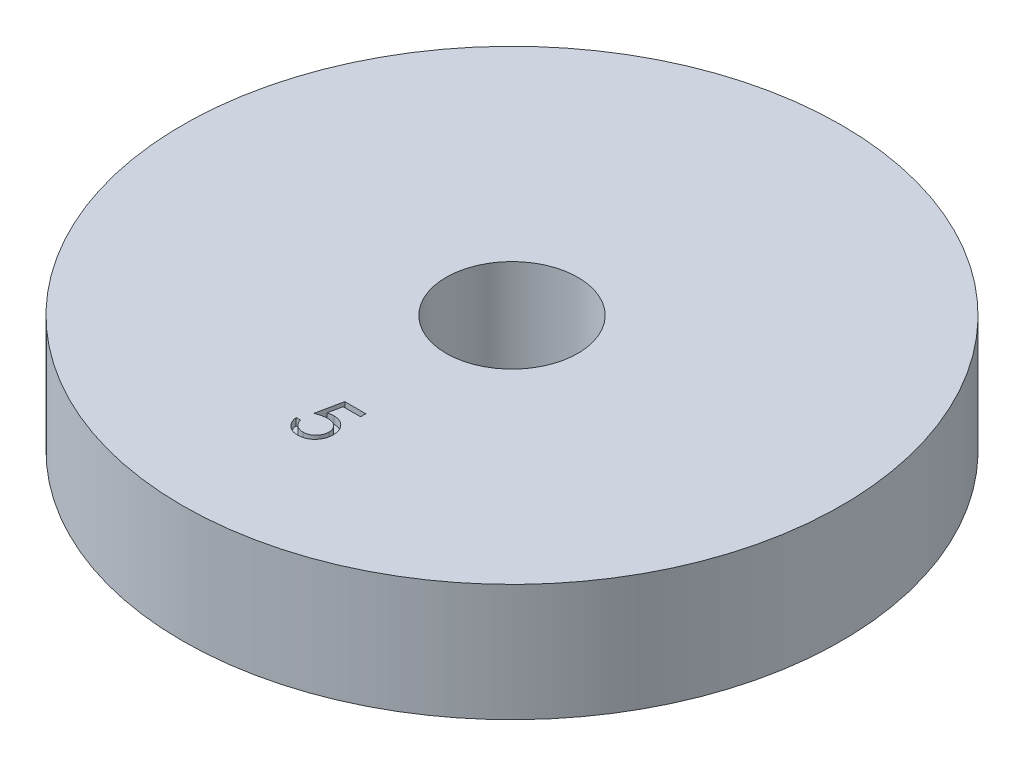
ISO-10303-21;
HEADER;
FILE_DESCRIPTION(('STEP AP214'),'2;1');
FILE_NAME('part.step','',(''),(''),'','','');
FILE_SCHEMA(('AUTOMOTIVE_DESIGN { 1 0 10303 214 1 1 1 1 }'));
ENDSEC;
DATA;
#1=APPLICATION_CONTEXT('core data for automotive mechanical design processes');
#2=APPLICATION_PROTOCOL_DEFINITION('international standard','automotive_design',2000,#1);
#3=PRODUCT_CONTEXT('',#1,'mechanical');
#4=PRODUCT('Part','Part','',(#3));
#5=PRODUCT_RELATED_PRODUCT_CATEGORY('part','',(#4));
#6=PRODUCT_DEFINITION_FORMATION('','',#4);
#7=PRODUCT_DEFINITION_CONTEXT('part definition',#1,'design');
#8=PRODUCT_DEFINITION('design','',#6,#7);
#9=PRODUCT_DEFINITION_SHAPE('','',#8);
#10=(LENGTH_UNIT() NAMED_UNIT(*) SI_UNIT(.MILLI.,.METRE.));
#11=(NAMED_UNIT(*) PLANE_ANGLE_UNIT() SI_UNIT($,.RADIAN.));
#12=(NAMED_UNIT(*) SI_UNIT($,.STERADIAN.) SOLID_ANGLE_UNIT());
#13=UNCERTAINTY_MEASURE_WITH_UNIT(LENGTH_MEASURE(1.E-05),#10,'distance_accuracy_value','');
#14=(GEOMETRIC_REPRESENTATION_CONTEXT(3) GLOBAL_UNCERTAINTY_ASSIGNED_CONTEXT((#13)) GLOBAL_UNIT_ASSIGNED_CONTEXT((#10,
#11,#12)) REPRESENTATION_CONTEXT('',''));
#15=CARTESIAN_POINT('',(0.,0.,0.));
#16=DIRECTION('',(0.,0.,1.));
#17=DIRECTION('',(1.,0.,0.));
#18=AXIS2_PLACEMENT_3D('',#15,#16,#17);
#19=CARTESIAN_POINT('',(0.,8.,0.));
#20=DIRECTION('',(0.,1.,0.));
#21=DIRECTION('',(0.,0.,1.));
#22=AXIS2_PLACEMENT_3D('',#19,#20,#21);
#23=PLANE('',#22);
#24=CARTESIAN_POINT('',(0.,8.,0.));
#25=DIRECTION('',(0.,1.,0.));
#26=DIRECTION('',(0.,0.,1.));
#27=AXIS2_PLACEMENT_3D('',#24,#25,#26);
#28=CIRCLE('',#27,4.5);
#29=CARTESIAN_POINT('',(0.,8.,4.5));
#30=VERTEX_POINT('',#29);
#31=EDGE_CURVE('E298',#30,#30,#28,.T.);
#32=ORIENTED_EDGE('',*,*,#31,.F.);
#33=EDGE_LOOP('',(#32));
#34=FACE_BOUND('',#33,.T.);
#35=CARTESIAN_POINT('',(0.,8.,0.));
#36=DIRECTION('',(0.,1.,0.));
#37=DIRECTION('',(0.,0.,1.));
#38=AXIS2_PLACEMENT_3D('',#35,#36,#37);
#39=CIRCLE('',#38,22.5);
#40=CARTESIAN_POINT('',(0.,8.,22.5));
#41=VERTEX_POINT('',#40);
#42=EDGE_CURVE('E11',#41,#41,#39,.T.);
#43=ORIENTED_EDGE('',*,*,#42,.T.);
#44=EDGE_LOOP('',(#43));
#45=FACE_BOUND('',#44,.T.);
#46=DIRECTION('',(0.200944143721331,0.,-0.97960270064149));
#47=VECTOR('',#46,1.);
#48=CARTESIAN_POINT('',(-0.967671836708835,8.,12.5582670641185));
#49=LINE('',#48,#47);
#50=CARTESIAN_POINT('',(-0.967671836708835,8.,12.5582670641185));
#51=VERTEX_POINT('',#50);
#52=CARTESIAN_POINT('',(-0.608697477734477,8.,10.8082670641185));
#53=VERTEX_POINT('',#52);
#54=EDGE_CURVE('E264',#51,#53,#49,.T.);
#55=ORIENTED_EDGE('',*,*,#54,.T.);
#56=DIRECTION('',(1.,0.,0.));
#57=VECTOR('',#56,1.);
#58=CARTESIAN_POINT('',(-0.608697477734476,8.,10.8082670641185));
#59=LINE('',#58,#57);
#60=CARTESIAN_POINT('',(0.82719995816296,8.,10.8082670641185));
#61=VERTEX_POINT('',#60);
#62=EDGE_CURVE('E54',#53,#61,#59,.T.);
#63=ORIENTED_EDGE('',*,*,#62,.T.);
#64=DIRECTION('',(0.,0.,1.));
#65=VECTOR('',#64,1.);
#66=CARTESIAN_POINT('',(0.82719995816296,8.,10.8082670641185));
#67=LINE('',#66,#65);
#68=CARTESIAN_POINT('',(0.82719995816296,8.,11.1672414230929));
#69=VERTEX_POINT('',#68);
#70=EDGE_CURVE('E357',#61,#69,#67,.T.);
#71=ORIENTED_EDGE('',*,*,#70,.T.);
#72=DIRECTION('',(-1.,0.,0.));
#73=VECTOR('',#72,1.);
#74=CARTESIAN_POINT('',(0.82719995816296,8.,11.1672414230929));
#75=LINE('',#74,#73);
#76=CARTESIAN_POINT('',(-0.363304849529348,8.,11.1672414230929));
#77=VERTEX_POINT('',#76);
#78=EDGE_CURVE('E353',#69,#77,#75,.T.);
#79=ORIENTED_EDGE('',*,*,#78,.T.);
#80=DIRECTION('',(-0.200705474463135,0.,0.979651628141621));
#81=VECTOR('',#80,1.);
#82=CARTESIAN_POINT('',(-0.363304849529348,8.,11.1672414230929));
#83=LINE('',#82,#81);
#84=CARTESIAN_POINT('',(-0.551906612349861,8.,12.0878143397596));
#85=VERTEX_POINT('',#84);
#86=EDGE_CURVE('E346',#77,#85,#83,.T.);
#87=ORIENTED_EDGE('',*,*,#86,.T.);
#88=CARTESIAN_POINT('',(-0.551906612349861,8.,12.0878143397596));
#89=CARTESIAN_POINT('',(-0.514850737976193,8.,12.0775840679493));
#90=CARTESIAN_POINT('',(-0.443060842143816,8.,12.0577645343393));
#91=CARTESIAN_POINT('',(-0.337100981180093,8.,12.0357587639098));
#92=CARTESIAN_POINT('',(-0.236508777709103,8.,12.0224933198524));
#93=CARTESIAN_POINT('',(-0.171233407298597,8.,12.0206820093402));
#94=CARTESIAN_POINT('',(-0.139646996965245,8.,12.019805525657));
#95=B_SPLINE_CURVE_WITH_KNOTS('',3,(#88,#89,#90,#91,#92,#93,#94),.UNSPECIFIED.,.F.,.F.,(4,1,1,1,
4),(0.,0.275068369018743,0.532901460089936,0.773973459592445,1.),.UNSPECIFIED.);
#96=CARTESIAN_POINT('',(-0.139646996965245,8.,12.019805525657));
#97=VERTEX_POINT('',#96);
#98=EDGE_CURVE('E352',#85,#97,#95,.T.);
#99=ORIENTED_EDGE('',*,*,#98,.T.);
#100=CARTESIAN_POINT('',(-0.139646996965245,8.,12.019805525657));
#101=CARTESIAN_POINT('',(-0.100563257253044,8.,12.0206514613516));
#102=CARTESIAN_POINT('',(-0.023714859927914,8.,12.0223147822839));
#103=CARTESIAN_POINT('',(0.0887240870657147,8.,12.0382866317282));
#104=CARTESIAN_POINT('',(0.196056980283833,8.,12.0634265463584));
#105=CARTESIAN_POINT('',(0.298059350460181,8.,12.0985470680951));
#106=CARTESIAN_POINT('',(0.39491990109746,8.,12.1434568012894));
#107=CARTESIAN_POINT('',(0.485747462577982,8.,12.1995567416473));
#108=CARTESIAN_POINT('',(0.571905375564809,8.,12.2650900727969));
#109=CARTESIAN_POINT('',(0.651847969518984,8.,12.3404350847565));
#110=CARTESIAN_POINT('',(0.724372277684403,8.,12.4233567015087));
#111=CARTESIAN_POINT('',(0.788138267351387,8.,12.5125145725522));
#112=CARTESIAN_POINT('',(0.84230085765566,8.,12.6070422346867));
#113=CARTESIAN_POINT('',(0.885861612532083,8.,12.707842843425));
#114=CARTESIAN_POINT('',(0.92064594680803,8.,12.8138019968353));
#115=CARTESIAN_POINT('',(0.943797941651836,8.,12.9260345793876));
#116=CARTESIAN_POINT('',(0.959214650613127,8.,13.043482699401));
#117=CARTESIAN_POINT('',(0.96093703693271,8.,13.1237872694781));
#118=CARTESIAN_POINT('',(0.961815342778344,8.,13.1647374166826));
#119=B_SPLINE_CURVE_WITH_KNOTS('',3,(#100,#101,#102,#103,#104,#105,#106,#107,#108,#109,#110,
#111,#112,#113,#114,#115,#116,#117,#118),.UNSPECIFIED.,.F.,.F.,(4,1,1,1,1,1,1,1,1,1,1,1,1,1,1,1,
4),(0.,0.0658076458106948,0.129394273668056,0.19089406063219,0.251281068929836,
0.310814964465273,0.370370987448245,0.430768262589727,0.492881250617502,0.55510394815525,
0.616067050993843,0.677256033174654,0.738259805199117,0.800762134376296,0.864777581574484,
0.931045294999404,1.),.UNSPECIFIED.);
#120=CARTESIAN_POINT('',(0.961815342778344,8.,13.1647374166826));
#121=VERTEX_POINT('',#120);
#122=EDGE_CURVE('E365',#97,#121,#119,.T.);
#123=ORIENTED_EDGE('',*,*,#122,.T.);
#124=CARTESIAN_POINT('',(0.961815342778344,8.,13.1647374166826));
#125=CARTESIAN_POINT('',(0.961150267504974,8.,13.1932596370346));
#126=CARTESIAN_POINT('',(0.95982910487507,8.,13.2499186246104));
#127=CARTESIAN_POINT('',(0.953110517227282,8.,13.3340628252957));
#128=CARTESIAN_POINT('',(0.940174801163103,8.,13.4164256583781));
#129=CARTESIAN_POINT('',(0.922807077059055,8.,13.4970180502168));
#130=CARTESIAN_POINT('',(0.900264659093549,8.,13.5756874223959));
#131=CARTESIAN_POINT('',(0.872975605191223,8.,13.6526589503227));
#132=CARTESIAN_POINT('',(0.839579577681365,8.,13.7274535570658));
#133=CARTESIAN_POINT('',(0.802948202422442,8.,13.8007789520896));
#134=CARTESIAN_POINT('',(0.761701724387125,8.,13.8709774592843));
#135=CARTESIAN_POINT('',(0.715923217048165,8.,13.936626445827));
#136=CARTESIAN_POINT('',(0.667557725825836,8.,13.998710727307));
#137=CARTESIAN_POINT('',(0.615516340367556,8.,14.0565644603161));
#138=CARTESIAN_POINT('',(0.559315345254962,8.,14.1098074782091));
#139=CARTESIAN_POINT('',(0.499635378393252,8.,14.1587557597151));
#140=CARTESIAN_POINT('',(0.436952659364128,8.,14.2042370900182));
#141=CARTESIAN_POINT('',(0.37029741704317,8.,14.2444052851937));
#142=CARTESIAN_POINT('',(0.301154934079605,8.,14.2813682413465));
#143=CARTESIAN_POINT('',(0.228526716939122,8.,14.3116917786818));
#144=CARTESIAN_POINT('',(0.154066016481617,8.,14.3388023067668));
#145=CARTESIAN_POINT('',(0.0767011408867827,8.,14.3604118343784));
#146=CARTESIAN_POINT('',(-0.00339267172897991,8.,14.3773443888977));
#147=CARTESIAN_POINT('',(-0.0863474472110704,8.,14.3888449895002));
#148=CARTESIAN_POINT('',(-0.171728117234819,8.,14.3972214269704));
#149=CARTESIAN_POINT('',(-0.229603129814692,8.,14.397745783921));
#150=CARTESIAN_POINT('',(-0.25883770209345,8.,14.3980106538621));
#151=B_SPLINE_CURVE_WITH_KNOTS('',3,(#124,#125,#126,#127,#128,#129,#130,#131,#132,#133,#134,
#135,#136,#137,#138,#139,#140,#141,#142,#143,#144,#145,#146,#147,#148,#149,#150),.UNSPECIFIED.,
.F.,.F.,(4,1,1,1,1,1,1,1,1,1,1,1,1,1,1,1,1,1,1,1,1,1,1,1,4),(0.,0.0440144705761401,
0.0874341236677053,0.130118398657898,0.172553694558183,0.214554755968139,0.256298092097131,
0.29843822513325,0.340849002588096,0.382715188967027,0.423924045407532,0.464246243250417,
0.504073671461796,0.543861905868492,0.583566724979654,0.623094318852334,0.663229060768585,
0.70355125861147,0.743937894686185,0.784541254800093,0.825750111240597,0.867757363388507,
0.91074516403231,0.954914446891478,1.),.UNSPECIFIED.);
#152=CARTESIAN_POINT('',(-0.25883770209345,8.,14.3980106538621));
#153=VERTEX_POINT('',#152);
#154=EDGE_CURVE('E373',#121,#153,#151,.T.);
#155=ORIENTED_EDGE('',*,*,#154,.T.);
#156=CARTESIAN_POINT('',(-0.25883770209345,8.,14.3980106538621));
#157=CARTESIAN_POINT('',(-0.29371188279566,8.,14.397319815878));
#158=CARTESIAN_POINT('',(-0.362322713499546,8.,14.3959606737556));
#159=CARTESIAN_POINT('',(-0.462843280571111,8.,14.3817421885015));
#160=CARTESIAN_POINT('',(-0.559557886264573,8.,14.361378272109));
#161=CARTESIAN_POINT('',(-0.651687987421995,8.,14.3307420022606));
#162=CARTESIAN_POINT('',(-0.740059251127233,8.,14.2923547075704));
#163=CARTESIAN_POINT('',(-0.823481968916085,8.00000000000001,14.243838536075));
#164=CARTESIAN_POINT('',(-0.904087744963954,8.,14.1888594323279));
#165=CARTESIAN_POINT('',(-0.978599781713458,8.,14.1239790793632));
#166=CARTESIAN_POINT('',(-1.04775589518311,8.,14.0530633973306));
#167=CARTESIAN_POINT('',(-1.10966240405344,8.,13.9761057561649));
#168=CARTESIAN_POINT('',(-1.1647959807901,8.,13.8943763140788));
#169=CARTESIAN_POINT('',(-1.21227372777894,8.,13.8074781600031));
#170=CARTESIAN_POINT('',(-1.25277174909533,8.,13.7156396290654));
#171=CARTESIAN_POINT('',(-1.28458673737204,8.,13.6185166281735));
#172=CARTESIAN_POINT('',(-1.31026509231516,8.,13.5166166242341));
#173=CARTESIAN_POINT('',(-1.32112851279152,8.,13.4464631138236));
#174=CARTESIAN_POINT('',(-1.32664619568319,8.,13.4108311666826));
#175=B_SPLINE_CURVE_WITH_KNOTS('',3,(#156,#157,#158,#159,#160,#161,#162,#163,#164,#165,#166,
#167,#168,#169,#170,#171,#172,#173,#174),.UNSPECIFIED.,.F.,.F.,(4,1,1,1,1,1,1,1,1,1,1,1,1,1,1,1,
4),(0.,0.0654211437588925,0.128708371881883,0.190236141863538,0.250724402033538,
0.310637179413444,0.370766408289726,0.431614744412353,0.493522973566354,0.555883455377533,
0.61734236731851,0.678668039097275,0.740711359545147,0.802985362512744,0.866802580265517,
0.932347171345887,1.),.UNSPECIFIED.);
#176=CARTESIAN_POINT('',(-1.32664619568319,8.,13.4108311666826));
#177=VERTEX_POINT('',#176);
#178=EDGE_CURVE('E381',#153,#177,#175,.T.);
#179=ORIENTED_EDGE('',*,*,#178,.T.);
#180=DIRECTION('',(1.,0.,0.));
#181=VECTOR('',#180,1.);
#182=CARTESIAN_POINT('',(-1.32664619568319,8.,13.4108311666826));
#183=LINE('',#182,#181);
#184=CARTESIAN_POINT('',(-1.01254363158063,8.,13.4108311666826));
#185=VERTEX_POINT('',#184);
#186=EDGE_CURVE('E389',#177,#185,#183,.T.);
#187=ORIENTED_EDGE('',*,*,#186,.T.);
#188=CARTESIAN_POINT('',(-1.01254363158063,8.,13.4108311666826));
#189=CARTESIAN_POINT('',(-1.00481507419047,8.,13.4442076191313));
#190=CARTESIAN_POINT('',(-0.989960357749593,8.,13.5083590140032));
#191=CARTESIAN_POINT('',(-0.957354608997612,8.,13.5984903553363));
#192=CARTESIAN_POINT('',(-0.917488733524893,8.,13.6788095790123));
#193=CARTESIAN_POINT('',(-0.870084385107619,8.,13.7503791622859));
#194=CARTESIAN_POINT('',(-0.813534354621399,8.,13.8127881595582));
#195=CARTESIAN_POINT('',(-0.749004925680748,8.,13.8684052214959));
#196=CARTESIAN_POINT('',(-0.676657202481521,8.,13.9185803508235));
#197=CARTESIAN_POINT('',(-0.596263972961626,8.,13.9604031180208));
#198=CARTESIAN_POINT('',(-0.511450893641255,8.,13.9960718714208));
#199=CARTESIAN_POINT('',(-0.422683683631667,8.,14.0198235663725));
#200=CARTESIAN_POINT('',(-0.332379337160577,8.,14.0365244592153));
#201=CARTESIAN_POINT('',(-0.271300966964081,8.,14.038196220017));
#202=CARTESIAN_POINT('',(-0.240608535426784,8.,14.0390362948878));
#203=B_SPLINE_CURVE_WITH_KNOTS('',3,(#188,#189,#190,#191,#192,#193,#194,#195,#196,#197,#198,
#199,#200,#201,#202),.UNSPECIFIED.,.F.,.F.,(4,1,1,1,1,1,1,1,1,1,1,1,4),(0.,0.094687251867555,
0.181994155707275,0.264376948610513,0.342179861947772,0.418617610862147,0.496509075371909,
0.577369091611732,0.661510592454199,0.746732550829198,0.831257984327743,0.915205616213655,1.),.UNSPECIFIED.);
#204=CARTESIAN_POINT('',(-0.240608535426784,8.,14.0390362948878));
#205=VERTEX_POINT('',#204);
#206=EDGE_CURVE('E395',#185,#205,#203,.T.);
#207=ORIENTED_EDGE('',*,*,#206,.T.);
#208=CARTESIAN_POINT('',(-0.240608535426784,8.,14.0390362948878));
#209=CARTESIAN_POINT('',(-0.210650091009496,8.,14.0382155169827));
#210=CARTESIAN_POINT('',(-0.151661668820922,8.,14.0365993985716));
#211=CARTESIAN_POINT('',(-0.064850282127918,8.,14.0241603864817));
#212=CARTESIAN_POINT('',(0.0189625920742209,8.,14.0050028151741));
#213=CARTESIAN_POINT('',(0.0989499488331858,8.,13.9763329601904));
#214=CARTESIAN_POINT('',(0.17651148842223,8.,13.9414882417645));
#215=CARTESIAN_POINT('',(0.249685258845327,8.,13.8967731659487));
#216=CARTESIAN_POINT('',(0.320588135985995,8.,13.8453131475037));
#217=CARTESIAN_POINT('',(0.387016269507047,8.,13.7863565174603));
#218=CARTESIAN_POINT('',(0.447855718766602,8.,13.721386822841));
#219=CARTESIAN_POINT('',(0.50161183990052,8.,13.6519094294161));
#220=CARTESIAN_POINT('',(0.546388753326672,8.,13.5777925828732));
#221=CARTESIAN_POINT('',(0.58412286219636,8.,13.5003194300223));
#222=CARTESIAN_POINT('',(0.612776161018993,8.,13.4186408728439));
#223=CARTESIAN_POINT('',(0.633217142241795,8.,13.3331396976715));
#224=CARTESIAN_POINT('',(0.645220201060291,8.,13.243604717465));
#225=CARTESIAN_POINT('',(0.646871381032259,8.,13.1825354076888));
#226=CARTESIAN_POINT('',(0.64771277867578,8.,13.1514161025801));
#227=B_SPLINE_CURVE_WITH_KNOTS('',3,(#208,#209,#210,#211,#212,#213,#214,#215,#216,#217,#218,
#219,#220,#221,#222,#223,#224,#225,#226),.UNSPECIFIED.,.F.,.F.,(4,1,1,1,1,1,1,1,1,1,1,1,1,1,1,1,
4),(0.,0.0642072952829856,0.126424689779743,0.187680284264922,0.248216424455213,
0.308305060008613,0.369660991325143,0.431698551786781,0.495946892208765,0.55975802397212,
0.622295407826159,0.683910635284175,0.745092408056625,0.806740225389293,0.869086618121203,
0.9332900029748,1.),.UNSPECIFIED.);
#228=CARTESIAN_POINT('',(0.64771277867578,8.,13.1514161025801));
#229=VERTEX_POINT('',#228);
#230=EDGE_CURVE('E400',#205,#229,#227,.T.);
#231=ORIENTED_EDGE('',*,*,#230,.T.);
#232=CARTESIAN_POINT('',(0.64771277867578,8.,13.1514161025801));
#233=CARTESIAN_POINT('',(0.647054299214329,8.,13.1233403509589));
#234=CARTESIAN_POINT('',(0.645765419359936,8.,13.0683860619037));
#235=CARTESIAN_POINT('',(0.635234849056979,8.,12.9879868554624));
#236=CARTESIAN_POINT('',(0.616917876703277,8.,12.9119138131608));
#237=CARTESIAN_POINT('',(0.591493996756317,8.,12.8397995791889));
#238=CARTESIAN_POINT('',(0.559214489022716,8.,12.7715761368408));
#239=CARTESIAN_POINT('',(0.519768176703893,8.,12.7071730766406));
#240=CARTESIAN_POINT('',(0.472414778760391,8.,12.6474392434172));
#241=CARTESIAN_POINT('',(0.418322890171726,8.,12.5923466898077));
#242=CARTESIAN_POINT('',(0.359064849228643,8.,12.5415018149345));
#243=CARTESIAN_POINT('',(0.293621106631516,8.,12.4981577284826));
#244=CARTESIAN_POINT('',(0.223361179836368,8.,12.4616938108308));
#245=CARTESIAN_POINT('',(0.149131580367511,8.,12.430225812488));
#246=CARTESIAN_POINT('',(0.0691666817801094,8.,12.4076250670887));
#247=CARTESIAN_POINT('',(-0.0149499505992889,8.,12.3906571816466));
#248=CARTESIAN_POINT('',(-0.104126658546245,8.,12.3808418189683));
#249=CARTESIAN_POINT('',(-0.165097346680199,8.,12.3794799305926));
#250=CARTESIAN_POINT('',(-0.196437862349861,8.,12.3787798846313));
#251=B_SPLINE_CURVE_WITH_KNOTS('',3,(#232,#233,#234,#235,#236,#237,#238,#239,#240,#241,#242,
#243,#244,#245,#246,#247,#248,#249,#250),.UNSPECIFIED.,.F.,.F.,(4,1,1,1,1,1,1,1,1,1,1,1,1,1,1,1,
4),(0.,0.0653513820265941,0.127916031830613,0.1883602055717,0.247216077265452,0.305630129197412,
0.363769839831819,0.422660913912781,0.482687294090392,0.543300221239559,0.604117955323103,
0.664964891265285,0.727413494112565,0.791467625149424,0.8580554427291,0.927036814614948,1.),.UNSPECIFIED.);
#252=CARTESIAN_POINT('',(-0.196437862349861,8.,12.3787798846313));
#253=VERTEX_POINT('',#252);
#254=EDGE_CURVE('E269',#229,#253,#251,.T.);
#255=ORIENTED_EDGE('',*,*,#254,.T.);
#256=CARTESIAN_POINT('',(-0.196437862349861,8.,12.3787798846313));
#257=CARTESIAN_POINT('',(-0.223566791156285,8.,12.3793604757889));
#258=CARTESIAN_POINT('',(-0.279581146480988,8.,12.3805592492323));
#259=CARTESIAN_POINT('',(-0.365503973210251,8.,12.3893857460586));
#260=CARTESIAN_POINT('',(-0.455795696186978,8.,12.4036250404867));
#261=CARTESIAN_POINT('',(-0.550110191743177,8.,12.4232112879559));
#262=CARTESIAN_POINT('',(-0.648730699846186,8.,12.4488423647145));
#263=CARTESIAN_POINT('',(-0.751449100573462,8.,12.4795568653401));
#264=CARTESIAN_POINT('',(-0.858481367172749,8.,12.5162788640537));
#265=CARTESIAN_POINT('',(-0.930599091571493,8.,12.5440110778004));
#266=CARTESIAN_POINT('',(-0.967671836708835,8.,12.5582670641185));
#267=B_SPLINE_CURVE_WITH_KNOTS('',3,(#256,#257,#258,#259,#260,#261,#262,#263,#264,#265,#266),
.UNSPECIFIED.,.F.,.F.,(4,1,1,1,1,1,1,1,4),(0.,0.10220303703522,0.211023342373876,
0.325099661565208,0.44650209713489,0.573787717648856,0.708900709766066,0.850357871293401,1.),.UNSPECIFIED.);
#268=EDGE_CURVE('E164',#253,#51,#267,.T.);
#269=ORIENTED_EDGE('',*,*,#268,.T.);
#270=EDGE_LOOP('',(#55,#63,#71,#79,#87,#99,#123,#155,#179,#187,#207,#231,#255,#269));
#271=FACE_BOUND('',#270,.T.);
#272=ADVANCED_FACE('F39',(#34,#45,#271),#23,.T.);
#273=CARTESIAN_POINT('',(0.,8.,0.));
#274=DIRECTION('',(0.,-1.,0.));
#275=DIRECTION('',(0.,0.,-1.));
#276=AXIS2_PLACEMENT_3D('',#273,#274,#275);
#277=CYLINDRICAL_SURFACE('',#276,22.5);
#278=ORIENTED_EDGE('',*,*,#42,.F.);
#279=EDGE_LOOP('',(#278));
#280=FACE_BOUND('',#279,.T.);
#281=CARTESIAN_POINT('',(0.,0.,0.));
#282=DIRECTION('',(0.,1.,0.));
#283=DIRECTION('',(0.,0.,1.));
#284=AXIS2_PLACEMENT_3D('',#281,#282,#283);
#285=CIRCLE('',#284,22.5);
#286=CARTESIAN_POINT('',(0.,0.,22.5));
#287=VERTEX_POINT('',#286);
#288=EDGE_CURVE('E43',#287,#287,#285,.T.);
#289=ORIENTED_EDGE('',*,*,#288,.T.);
#290=EDGE_LOOP('',(#289));
#291=FACE_BOUND('',#290,.T.);
#292=ADVANCED_FACE('F41',(#280,#291),#277,.T.);
#293=CARTESIAN_POINT('',(0.,0.,0.));
#294=DIRECTION('',(0.,1.,0.));
#295=DIRECTION('',(0.,0.,1.));
#296=AXIS2_PLACEMENT_3D('',#293,#294,#295);
#297=PLANE('',#296);
#298=CARTESIAN_POINT('',(0.,0.,0.));
#299=DIRECTION('',(0.,1.,0.));
#300=DIRECTION('',(0.,0.,1.));
#301=AXIS2_PLACEMENT_3D('',#298,#299,#300);
#302=CIRCLE('',#301,4.5);
#303=CARTESIAN_POINT('',(0.,0.,4.5));
#304=VERTEX_POINT('',#303);
#305=EDGE_CURVE('E299',#304,#304,#302,.T.);
#306=ORIENTED_EDGE('',*,*,#305,.T.);
#307=EDGE_LOOP('',(#306));
#308=FACE_BOUND('',#307,.T.);
#309=ORIENTED_EDGE('',*,*,#288,.F.);
#310=EDGE_LOOP('',(#309));
#311=FACE_BOUND('',#310,.T.);
#312=ADVANCED_FACE('F314',(#308,#311),#297,.F.);
#313=CARTESIAN_POINT('',(0.,0.,0.));
#314=DIRECTION('',(0.,1.,0.));
#315=DIRECTION('',(0.,0.,1.));
#316=AXIS2_PLACEMENT_3D('',#313,#314,#315);
#317=CYLINDRICAL_SURFACE('',#316,4.5);
#318=ORIENTED_EDGE('',*,*,#305,.F.);
#319=EDGE_LOOP('',(#318));
#320=FACE_BOUND('',#319,.T.);
#321=ORIENTED_EDGE('',*,*,#31,.T.);
#322=EDGE_LOOP('',(#321));
#323=FACE_BOUND('',#322,.T.);
#324=ADVANCED_FACE('F305',(#320,#323),#317,.F.);
#325=CARTESIAN_POINT('',(-0.608697477734476,7.5,10.8082670641185));
#326=DIRECTION('',(0.,0.,1.));
#327=DIRECTION('',(1.,0.,0.));
#328=AXIS2_PLACEMENT_3D('',#325,#326,#327);
#329=PLANE('',#328);
#330=ORIENTED_EDGE('',*,*,#62,.F.);
#331=DIRECTION('',(0.,1.,0.));
#332=VECTOR('',#331,1.);
#333=CARTESIAN_POINT('',(-0.608697477734476,7.5,10.8082670641185));
#334=LINE('',#333,#332);
#335=CARTESIAN_POINT('',(-0.608697477734476,7.5,10.8082670641185));
#336=VERTEX_POINT('',#335);
#337=EDGE_CURVE('E169',#336,#53,#334,.T.);
#338=ORIENTED_EDGE('',*,*,#337,.F.);
#339=DIRECTION('',(1.,0.,0.));
#340=VECTOR('',#339,1.);
#341=CARTESIAN_POINT('',(-0.608697477734476,7.5,10.8082670641185));
#342=LINE('',#341,#340);
#343=CARTESIAN_POINT('',(0.82719995816296,7.5,10.8082670641185));
#344=VERTEX_POINT('',#343);
#345=EDGE_CURVE('E263',#336,#344,#342,.T.);
#346=ORIENTED_EDGE('',*,*,#345,.T.);
#347=DIRECTION('',(0.,1.,0.));
#348=VECTOR('',#347,1.);
#349=CARTESIAN_POINT('',(0.82719995816296,7.5,10.8082670641185));
#350=LINE('',#349,#348);
#351=EDGE_CURVE('E296',#344,#61,#350,.T.);
#352=ORIENTED_EDGE('',*,*,#351,.T.);
#353=EDGE_LOOP('',(#330,#338,#346,#352));
#354=FACE_BOUND('',#353,.T.);
#355=ADVANCED_FACE('F323',(#354),#329,.T.);
#356=CARTESIAN_POINT('',(0.82719995816296,7.5,10.8082670641185));
#357=DIRECTION('',(-1.,0.,0.));
#358=DIRECTION('',(0.,0.,1.));
#359=AXIS2_PLACEMENT_3D('',#356,#357,#358);
#360=PLANE('',#359);
#361=ORIENTED_EDGE('',*,*,#70,.F.);
#362=ORIENTED_EDGE('',*,*,#351,.F.);
#363=DIRECTION('',(0.,0.,1.));
#364=VECTOR('',#363,1.);
#365=CARTESIAN_POINT('',(0.82719995816296,7.5,10.8082670641185));
#366=LINE('',#365,#364);
#367=CARTESIAN_POINT('',(0.82719995816296,7.5,11.1672414230929));
#368=VERTEX_POINT('',#367);
#369=EDGE_CURVE('E117',#344,#368,#366,.T.);
#370=ORIENTED_EDGE('',*,*,#369,.T.);
#371=DIRECTION('',(0.,1.,0.));
#372=VECTOR('',#371,1.);
#373=CARTESIAN_POINT('',(0.82719995816296,7.5,11.1672414230929));
#374=LINE('',#373,#372);
#375=EDGE_CURVE('E294',#368,#69,#374,.T.);
#376=ORIENTED_EDGE('',*,*,#375,.T.);
#377=EDGE_LOOP('',(#361,#362,#370,#376));
#378=FACE_BOUND('',#377,.T.);
#379=ADVANCED_FACE('F329',(#378),#360,.T.);
#380=CARTESIAN_POINT('',(0.82719995816296,7.5,11.1672414230929));
#381=DIRECTION('',(0.,0.,-1.));
#382=DIRECTION('',(-1.,0.,0.));
#383=AXIS2_PLACEMENT_3D('',#380,#381,#382);
#384=PLANE('',#383);
#385=ORIENTED_EDGE('',*,*,#78,.F.);
#386=ORIENTED_EDGE('',*,*,#375,.F.);
#387=DIRECTION('',(-1.,0.,0.));
#388=VECTOR('',#387,1.);
#389=CARTESIAN_POINT('',(0.82719995816296,7.5,11.1672414230929));
#390=LINE('',#389,#388);
#391=CARTESIAN_POINT('',(-0.363304849529348,7.5,11.1672414230929));
#392=VERTEX_POINT('',#391);
#393=EDGE_CURVE('E260',#368,#392,#390,.T.);
#394=ORIENTED_EDGE('',*,*,#393,.T.);
#395=DIRECTION('',(0.,1.,0.));
#396=VECTOR('',#395,1.);
#397=CARTESIAN_POINT('',(-0.363304849529348,7.5,11.1672414230929));
#398=LINE('',#397,#396);
#399=EDGE_CURVE('E292',#392,#77,#398,.T.);
#400=ORIENTED_EDGE('',*,*,#399,.T.);
#401=EDGE_LOOP('',(#385,#386,#394,#400));
#402=FACE_BOUND('',#401,.T.);
#403=ADVANCED_FACE('F332',(#402),#384,.T.);
#404=CARTESIAN_POINT('',(-0.363304849529348,7.5,11.1672414230929));
#405=DIRECTION('',(-0.979651628141621,0.,-0.200705474463135));
#406=DIRECTION('',(-0.200705474463135,0.,0.979651628141621));
#407=AXIS2_PLACEMENT_3D('',#404,#405,#406);
#408=PLANE('',#407);
#409=ORIENTED_EDGE('',*,*,#86,.F.);
#410=ORIENTED_EDGE('',*,*,#399,.F.);
#411=DIRECTION('',(-0.200705474463135,0.,0.979651628141621));
#412=VECTOR('',#411,1.);
#413=CARTESIAN_POINT('',(-0.363304849529348,7.5,11.1672414230929));
#414=LINE('',#413,#412);
#415=CARTESIAN_POINT('',(-0.551906612349861,7.5,12.0878143397596));
#416=VERTEX_POINT('',#415);
#417=EDGE_CURVE('E255',#392,#416,#414,.T.);
#418=ORIENTED_EDGE('',*,*,#417,.T.);
#419=DIRECTION('',(0.,1.,0.));
#420=VECTOR('',#419,1.);
#421=CARTESIAN_POINT('',(-0.551906612349861,7.5,12.0878143397596));
#422=LINE('',#421,#420);
#423=EDGE_CURVE('E290',#416,#85,#422,.T.);
#424=ORIENTED_EDGE('',*,*,#423,.T.);
#425=EDGE_LOOP('',(#409,#410,#418,#424));
#426=FACE_BOUND('',#425,.T.);
#427=ADVANCED_FACE('F335',(#426),#408,.T.);
#428=CARTESIAN_POINT('',(-0.551906612349861,7.5,12.0878143397596));
#429=CARTESIAN_POINT('',(-0.514850737976193,7.5,12.0775840679493));
#430=CARTESIAN_POINT('',(-0.443060842143816,7.5,12.0577645343393));
#431=CARTESIAN_POINT('',(-0.337100981180093,7.5,12.0357587639098));
#432=CARTESIAN_POINT('',(-0.236508777709103,7.5,12.0224933198524));
#433=CARTESIAN_POINT('',(-0.171233407298597,7.5,12.0206820093402));
#434=CARTESIAN_POINT('',(-0.139646996965245,7.5,12.019805525657));
#435=B_SPLINE_CURVE_WITH_KNOTS('',3,(#428,#429,#430,#431,#432,#433,#434),.UNSPECIFIED.,.F.,.F.,
(4,1,1,1,4),(0.,0.275068369018743,0.532901460089936,0.773973459592445,1.),.UNSPECIFIED.);
#436=DIRECTION('',(0.,1.,0.));
#437=VECTOR('',#436,1.);
#438=SURFACE_OF_LINEAR_EXTRUSION('',#435,#437);
#439=ORIENTED_EDGE('',*,*,#98,.F.);
#440=ORIENTED_EDGE('',*,*,#423,.F.);
#441=CARTESIAN_POINT('',(-0.139646996965245,7.5,12.019805525657));
#442=VERTEX_POINT('',#441);
#443=EDGE_CURVE('E247',#416,#442,#435,.T.);
#444=ORIENTED_EDGE('',*,*,#443,.T.);
#445=DIRECTION('',(0.,1.,0.));
#446=VECTOR('',#445,1.);
#447=CARTESIAN_POINT('',(-0.139646996965245,7.5,12.019805525657));
#448=LINE('',#447,#446);
#449=EDGE_CURVE('E288',#442,#97,#448,.T.);
#450=ORIENTED_EDGE('',*,*,#449,.T.);
#451=EDGE_LOOP('',(#439,#440,#444,#450));
#452=FACE_BOUND('',#451,.T.);
#453=ADVANCED_FACE('F239',(#452),#438,.T.);
#454=CARTESIAN_POINT('',(-0.139646996965245,7.5,12.019805525657));
#455=CARTESIAN_POINT('',(-0.100563257253044,7.5,12.0206514613516));
#456=CARTESIAN_POINT('',(-0.023714859927914,7.5,12.0223147822839));
#457=CARTESIAN_POINT('',(0.0887240870657147,7.5,12.0382866317282));
#458=CARTESIAN_POINT('',(0.196056980283833,7.5,12.0634265463584));
#459=CARTESIAN_POINT('',(0.298059350460181,7.5,12.0985470680951));
#460=CARTESIAN_POINT('',(0.39491990109746,7.5,12.1434568012894));
#461=CARTESIAN_POINT('',(0.485747462577982,7.5,12.1995567416473));
#462=CARTESIAN_POINT('',(0.571905375564809,7.5,12.2650900727969));
#463=CARTESIAN_POINT('',(0.651847969518984,7.5,12.3404350847565));
#464=CARTESIAN_POINT('',(0.724372277684403,7.5,12.4233567015087));
#465=CARTESIAN_POINT('',(0.788138267351387,7.5,12.5125145725522));
#466=CARTESIAN_POINT('',(0.84230085765566,7.5,12.6070422346867));
#467=CARTESIAN_POINT('',(0.885861612532083,7.5,12.707842843425));
#468=CARTESIAN_POINT('',(0.92064594680803,7.5,12.8138019968353));
#469=CARTESIAN_POINT('',(0.943797941651836,7.5,12.9260345793876));
#470=CARTESIAN_POINT('',(0.959214650613127,7.5,13.043482699401));
#471=CARTESIAN_POINT('',(0.96093703693271,7.5,13.1237872694781));
#472=CARTESIAN_POINT('',(0.961815342778344,7.5,13.1647374166826));
#473=B_SPLINE_CURVE_WITH_KNOTS('',3,(#454,#455,#456,#457,#458,#459,#460,#461,#462,#463,#464,
#465,#466,#467,#468,#469,#470,#471,#472),.UNSPECIFIED.,.F.,.F.,(4,1,1,1,1,1,1,1,1,1,1,1,1,1,1,1,
4),(0.,0.0658076458106948,0.129394273668056,0.19089406063219,0.251281068929836,
0.310814964465273,0.370370987448245,0.430768262589727,0.492881250617502,0.55510394815525,
0.616067050993843,0.677256033174654,0.738259805199117,0.800762134376296,0.864777581574484,
0.931045294999404,1.),.UNSPECIFIED.);
#474=DIRECTION('',(0.,1.,0.));
#475=VECTOR('',#474,1.);
#476=SURFACE_OF_LINEAR_EXTRUSION('',#473,#475);
#477=ORIENTED_EDGE('',*,*,#122,.F.);
#478=ORIENTED_EDGE('',*,*,#449,.F.);
#479=CARTESIAN_POINT('',(0.961815342778344,7.5,13.1647374166826));
#480=VERTEX_POINT('',#479);
#481=EDGE_CURVE('E243',#442,#480,#473,.T.);
#482=ORIENTED_EDGE('',*,*,#481,.T.);
#483=DIRECTION('',(0.,1.,0.));
#484=VECTOR('',#483,1.);
#485=CARTESIAN_POINT('',(0.961815342778344,7.5,13.1647374166826));
#486=LINE('',#485,#484);
#487=EDGE_CURVE('E286',#480,#121,#486,.T.);
#488=ORIENTED_EDGE('',*,*,#487,.T.);
#489=EDGE_LOOP('',(#477,#478,#482,#488));
#490=FACE_BOUND('',#489,.T.);
#491=ADVANCED_FACE('F235',(#490),#476,.T.);
#492=CARTESIAN_POINT('',(0.961815342778344,7.5,13.1647374166826));
#493=CARTESIAN_POINT('',(0.961150267504974,7.5,13.1932596370346));
#494=CARTESIAN_POINT('',(0.95982910487507,7.5,13.2499186246104));
#495=CARTESIAN_POINT('',(0.953110517227282,7.5,13.3340628252957));
#496=CARTESIAN_POINT('',(0.940174801163103,7.5,13.4164256583781));
#497=CARTESIAN_POINT('',(0.922807077059055,7.5,13.4970180502168));
#498=CARTESIAN_POINT('',(0.900264659093549,7.5,13.5756874223959));
#499=CARTESIAN_POINT('',(0.872975605191223,7.5,13.6526589503227));
#500=CARTESIAN_POINT('',(0.839579577681365,7.5,13.7274535570658));
#501=CARTESIAN_POINT('',(0.802948202422442,7.5,13.8007789520896));
#502=CARTESIAN_POINT('',(0.761701724387125,7.5,13.8709774592843));
#503=CARTESIAN_POINT('',(0.715923217048165,7.5,13.936626445827));
#504=CARTESIAN_POINT('',(0.667557725825836,7.5,13.998710727307));
#505=CARTESIAN_POINT('',(0.615516340367556,7.5,14.0565644603161));
#506=CARTESIAN_POINT('',(0.559315345254962,7.5,14.1098074782091));
#507=CARTESIAN_POINT('',(0.499635378393252,7.5,14.1587557597151));
#508=CARTESIAN_POINT('',(0.436952659364128,7.5,14.2042370900182));
#509=CARTESIAN_POINT('',(0.37029741704317,7.5,14.2444052851937));
#510=CARTESIAN_POINT('',(0.301154934079605,7.5,14.2813682413465));
#511=CARTESIAN_POINT('',(0.228526716939122,7.5,14.3116917786818));
#512=CARTESIAN_POINT('',(0.154066016481617,7.5,14.3388023067668));
#513=CARTESIAN_POINT('',(0.0767011408867827,7.5,14.3604118343784));
#514=CARTESIAN_POINT('',(-0.00339267172897991,7.5,14.3773443888977));
#515=CARTESIAN_POINT('',(-0.0863474472110704,7.5,14.3888449895002));
#516=CARTESIAN_POINT('',(-0.171728117234819,7.5,14.3972214269704));
#517=CARTESIAN_POINT('',(-0.229603129814692,7.5,14.397745783921));
#518=CARTESIAN_POINT('',(-0.25883770209345,7.5,14.3980106538621));
#519=B_SPLINE_CURVE_WITH_KNOTS('',3,(#492,#493,#494,#495,#496,#497,#498,#499,#500,#501,#502,
#503,#504,#505,#506,#507,#508,#509,#510,#511,#512,#513,#514,#515,#516,#517,#518),.UNSPECIFIED.,
.F.,.F.,(4,1,1,1,1,1,1,1,1,1,1,1,1,1,1,1,1,1,1,1,1,1,1,1,4),(0.,0.0440144705761401,
0.0874341236677053,0.130118398657898,0.172553694558183,0.214554755968139,0.256298092097131,
0.29843822513325,0.340849002588096,0.382715188967027,0.423924045407532,0.464246243250417,
0.504073671461796,0.543861905868492,0.583566724979654,0.623094318852334,0.663229060768585,
0.70355125861147,0.743937894686185,0.784541254800093,0.825750111240597,0.867757363388507,
0.91074516403231,0.954914446891478,1.),.UNSPECIFIED.);
#520=DIRECTION('',(0.,1.,0.));
#521=VECTOR('',#520,1.);
#522=SURFACE_OF_LINEAR_EXTRUSION('',#519,#521);
#523=ORIENTED_EDGE('',*,*,#154,.F.);
#524=ORIENTED_EDGE('',*,*,#487,.F.);
#525=CARTESIAN_POINT('',(-0.25883770209345,7.5,14.3980106538621));
#526=VERTEX_POINT('',#525);
#527=EDGE_CURVE('E218',#480,#526,#519,.T.);
#528=ORIENTED_EDGE('',*,*,#527,.T.);
#529=DIRECTION('',(0.,1.,0.));
#530=VECTOR('',#529,1.);
#531=CARTESIAN_POINT('',(-0.25883770209345,7.5,14.3980106538621));
#532=LINE('',#531,#530);
#533=EDGE_CURVE('E284',#526,#153,#532,.T.);
#534=ORIENTED_EDGE('',*,*,#533,.T.);
#535=EDGE_LOOP('',(#523,#524,#528,#534));
#536=FACE_BOUND('',#535,.T.);
#537=ADVANCED_FACE('F231',(#536),#522,.T.);
#538=CARTESIAN_POINT('',(-0.25883770209345,7.5,14.3980106538621));
#539=CARTESIAN_POINT('',(-0.29371188279566,7.5,14.397319815878));
#540=CARTESIAN_POINT('',(-0.362322713499546,7.5,14.3959606737556));
#541=CARTESIAN_POINT('',(-0.462843280571111,7.5,14.3817421885015));
#542=CARTESIAN_POINT('',(-0.559557886264573,7.5,14.361378272109));
#543=CARTESIAN_POINT('',(-0.651687987421995,7.5,14.3307420022606));
#544=CARTESIAN_POINT('',(-0.740059251127233,7.5,14.2923547075704));
#545=CARTESIAN_POINT('',(-0.823481968916085,7.50000000000001,14.243838536075));
#546=CARTESIAN_POINT('',(-0.904087744963954,7.5,14.1888594323279));
#547=CARTESIAN_POINT('',(-0.978599781713458,7.5,14.1239790793632));
#548=CARTESIAN_POINT('',(-1.04775589518311,7.5,14.0530633973306));
#549=CARTESIAN_POINT('',(-1.10966240405344,7.5,13.9761057561649));
#550=CARTESIAN_POINT('',(-1.1647959807901,7.5,13.8943763140788));
#551=CARTESIAN_POINT('',(-1.21227372777894,7.5,13.8074781600031));
#552=CARTESIAN_POINT('',(-1.25277174909533,7.5,13.7156396290654));
#553=CARTESIAN_POINT('',(-1.28458673737204,7.5,13.6185166281735));
#554=CARTESIAN_POINT('',(-1.31026509231516,7.5,13.5166166242341));
#555=CARTESIAN_POINT('',(-1.32112851279152,7.5,13.4464631138236));
#556=CARTESIAN_POINT('',(-1.32664619568319,7.5,13.4108311666826));
#557=B_SPLINE_CURVE_WITH_KNOTS('',3,(#538,#539,#540,#541,#542,#543,#544,#545,#546,#547,#548,
#549,#550,#551,#552,#553,#554,#555,#556),.UNSPECIFIED.,.F.,.F.,(4,1,1,1,1,1,1,1,1,1,1,1,1,1,1,1,
4),(0.,0.0654211437588925,0.128708371881883,0.190236141863538,0.250724402033538,
0.310637179413444,0.370766408289726,0.431614744412353,0.493522973566354,0.555883455377533,
0.61734236731851,0.678668039097275,0.740711359545147,0.802985362512744,0.866802580265517,
0.932347171345887,1.),.UNSPECIFIED.);
#558=DIRECTION('',(0.,1.,0.));
#559=VECTOR('',#558,1.);
#560=SURFACE_OF_LINEAR_EXTRUSION('',#557,#559);
#561=ORIENTED_EDGE('',*,*,#178,.F.);
#562=ORIENTED_EDGE('',*,*,#533,.F.);
#563=CARTESIAN_POINT('',(-1.32664619568319,7.5,13.4108311666826));
#564=VERTEX_POINT('',#563);
#565=EDGE_CURVE('E213',#526,#564,#557,.T.);
#566=ORIENTED_EDGE('',*,*,#565,.T.);
#567=DIRECTION('',(0.,1.,0.));
#568=VECTOR('',#567,1.);
#569=CARTESIAN_POINT('',(-1.32664619568319,7.5,13.4108311666826));
#570=LINE('',#569,#568);
#571=EDGE_CURVE('E282',#564,#177,#570,.T.);
#572=ORIENTED_EDGE('',*,*,#571,.T.);
#573=EDGE_LOOP('',(#561,#562,#566,#572));
#574=FACE_BOUND('',#573,.T.);
#575=ADVANCED_FACE('F227',(#574),#560,.T.);
#576=CARTESIAN_POINT('',(-1.32664619568319,7.5,13.4108311666826));
#577=DIRECTION('',(0.,0.,1.));
#578=DIRECTION('',(1.,0.,0.));
#579=AXIS2_PLACEMENT_3D('',#576,#577,#578);
#580=PLANE('',#579);
#581=ORIENTED_EDGE('',*,*,#186,.F.);
#582=ORIENTED_EDGE('',*,*,#571,.F.);
#583=DIRECTION('',(1.,0.,0.));
#584=VECTOR('',#583,1.);
#585=CARTESIAN_POINT('',(-1.32664619568319,7.5,13.4108311666826));
#586=LINE('',#585,#584);
#587=CARTESIAN_POINT('',(-1.01254363158063,7.5,13.4108311666826));
#588=VERTEX_POINT('',#587);
#589=EDGE_CURVE('E208',#564,#588,#586,.T.);
#590=ORIENTED_EDGE('',*,*,#589,.T.);
#591=DIRECTION('',(0.,1.,0.));
#592=VECTOR('',#591,1.);
#593=CARTESIAN_POINT('',(-1.01254363158063,7.5,13.4108311666826));
#594=LINE('',#593,#592);
#595=EDGE_CURVE('E280',#588,#185,#594,.T.);
#596=ORIENTED_EDGE('',*,*,#595,.T.);
#597=EDGE_LOOP('',(#581,#582,#590,#596));
#598=FACE_BOUND('',#597,.T.);
#599=ADVANCED_FACE('F230',(#598),#580,.T.);
#600=CARTESIAN_POINT('',(-1.01254363158063,7.5,13.4108311666826));
#601=CARTESIAN_POINT('',(-1.00481507419047,7.5,13.4442076191313));
#602=CARTESIAN_POINT('',(-0.989960357749593,7.5,13.5083590140032));
#603=CARTESIAN_POINT('',(-0.957354608997612,7.5,13.5984903553363));
#604=CARTESIAN_POINT('',(-0.917488733524893,7.5,13.6788095790123));
#605=CARTESIAN_POINT('',(-0.870084385107619,7.5,13.7503791622859));
#606=CARTESIAN_POINT('',(-0.813534354621399,7.5,13.8127881595582));
#607=CARTESIAN_POINT('',(-0.749004925680748,7.5,13.8684052214959));
#608=CARTESIAN_POINT('',(-0.676657202481521,7.5,13.9185803508235));
#609=CARTESIAN_POINT('',(-0.596263972961626,7.5,13.9604031180208));
#610=CARTESIAN_POINT('',(-0.511450893641255,7.5,13.9960718714208));
#611=CARTESIAN_POINT('',(-0.422683683631667,7.5,14.0198235663725));
#612=CARTESIAN_POINT('',(-0.332379337160577,7.5,14.0365244592153));
#613=CARTESIAN_POINT('',(-0.271300966964081,7.5,14.038196220017));
#614=CARTESIAN_POINT('',(-0.240608535426784,7.5,14.0390362948878));
#615=B_SPLINE_CURVE_WITH_KNOTS('',3,(#600,#601,#602,#603,#604,#605,#606,#607,#608,#609,#610,
#611,#612,#613,#614),.UNSPECIFIED.,.F.,.F.,(4,1,1,1,1,1,1,1,1,1,1,1,4),(0.,0.094687251867555,
0.181994155707275,0.264376948610513,0.342179861947772,0.418617610862147,0.496509075371909,
0.577369091611732,0.661510592454199,0.746732550829198,0.831257984327743,0.915205616213655,1.),.UNSPECIFIED.);
#616=DIRECTION('',(0.,1.,0.));
#617=VECTOR('',#616,1.);
#618=SURFACE_OF_LINEAR_EXTRUSION('',#615,#617);
#619=ORIENTED_EDGE('',*,*,#206,.F.);
#620=ORIENTED_EDGE('',*,*,#595,.F.);
#621=CARTESIAN_POINT('',(-0.240608535426784,7.5,14.0390362948878));
#622=VERTEX_POINT('',#621);
#623=EDGE_CURVE('E200',#588,#622,#615,.T.);
#624=ORIENTED_EDGE('',*,*,#623,.T.);
#625=DIRECTION('',(0.,1.,0.));
#626=VECTOR('',#625,1.);
#627=CARTESIAN_POINT('',(-0.240608535426784,7.5,14.0390362948878));
#628=LINE('',#627,#626);
#629=EDGE_CURVE('E278',#622,#205,#628,.T.);
#630=ORIENTED_EDGE('',*,*,#629,.T.);
#631=EDGE_LOOP('',(#619,#620,#624,#630));
#632=FACE_BOUND('',#631,.T.);
#633=ADVANCED_FACE('F193',(#632),#618,.T.);
#634=CARTESIAN_POINT('',(-0.240608535426784,7.5,14.0390362948878));
#635=CARTESIAN_POINT('',(-0.210650091009496,7.5,14.0382155169827));
#636=CARTESIAN_POINT('',(-0.151661668820922,7.5,14.0365993985716));
#637=CARTESIAN_POINT('',(-0.064850282127918,7.5,14.0241603864817));
#638=CARTESIAN_POINT('',(0.0189625920742209,7.5,14.0050028151741));
#639=CARTESIAN_POINT('',(0.0989499488331858,7.5,13.9763329601904));
#640=CARTESIAN_POINT('',(0.17651148842223,7.5,13.9414882417645));
#641=CARTESIAN_POINT('',(0.249685258845327,7.5,13.8967731659487));
#642=CARTESIAN_POINT('',(0.320588135985995,7.5,13.8453131475037));
#643=CARTESIAN_POINT('',(0.387016269507047,7.5,13.7863565174603));
#644=CARTESIAN_POINT('',(0.447855718766602,7.5,13.721386822841));
#645=CARTESIAN_POINT('',(0.50161183990052,7.5,13.6519094294161));
#646=CARTESIAN_POINT('',(0.546388753326672,7.5,13.5777925828732));
#647=CARTESIAN_POINT('',(0.58412286219636,7.5,13.5003194300223));
#648=CARTESIAN_POINT('',(0.612776161018993,7.5,13.4186408728439));
#649=CARTESIAN_POINT('',(0.633217142241795,7.5,13.3331396976715));
#650=CARTESIAN_POINT('',(0.645220201060291,7.5,13.243604717465));
#651=CARTESIAN_POINT('',(0.646871381032259,7.5,13.1825354076888));
#652=CARTESIAN_POINT('',(0.64771277867578,7.5,13.1514161025801));
#653=B_SPLINE_CURVE_WITH_KNOTS('',3,(#634,#635,#636,#637,#638,#639,#640,#641,#642,#643,#644,
#645,#646,#647,#648,#649,#650,#651,#652),.UNSPECIFIED.,.F.,.F.,(4,1,1,1,1,1,1,1,1,1,1,1,1,1,1,1,
4),(0.,0.0642072952829856,0.126424689779743,0.187680284264922,0.248216424455213,
0.308305060008613,0.369660991325143,0.431698551786781,0.495946892208765,0.55975802397212,
0.622295407826159,0.683910635284175,0.745092408056625,0.806740225389293,0.869086618121203,
0.9332900029748,1.),.UNSPECIFIED.);
#654=DIRECTION('',(0.,1.,0.));
#655=VECTOR('',#654,1.);
#656=SURFACE_OF_LINEAR_EXTRUSION('',#653,#655);
#657=ORIENTED_EDGE('',*,*,#230,.F.);
#658=ORIENTED_EDGE('',*,*,#629,.F.);
#659=CARTESIAN_POINT('',(0.64771277867578,7.5,13.1514161025801));
#660=VERTEX_POINT('',#659);
#661=EDGE_CURVE('E160',#622,#660,#653,.T.);
#662=ORIENTED_EDGE('',*,*,#661,.T.);
#663=DIRECTION('',(0.,1.,0.));
#664=VECTOR('',#663,1.);
#665=CARTESIAN_POINT('',(0.64771277867578,7.5,13.1514161025801));
#666=LINE('',#665,#664);
#667=EDGE_CURVE('E156',#660,#229,#666,.T.);
#668=ORIENTED_EDGE('',*,*,#667,.T.);
#669=EDGE_LOOP('',(#657,#658,#662,#668));
#670=FACE_BOUND('',#669,.T.);
#671=ADVANCED_FACE('F190',(#670),#656,.T.);
#672=CARTESIAN_POINT('',(0.64771277867578,7.5,13.1514161025801));
#673=CARTESIAN_POINT('',(0.647054299214329,7.5,13.1233403509589));
#674=CARTESIAN_POINT('',(0.645765419359936,7.5,13.0683860619037));
#675=CARTESIAN_POINT('',(0.635234849056979,7.5,12.9879868554624));
#676=CARTESIAN_POINT('',(0.616917876703277,7.5,12.9119138131608));
#677=CARTESIAN_POINT('',(0.591493996756317,7.5,12.8397995791889));
#678=CARTESIAN_POINT('',(0.559214489022716,7.5,12.7715761368408));
#679=CARTESIAN_POINT('',(0.519768176703893,7.5,12.7071730766406));
#680=CARTESIAN_POINT('',(0.472414778760391,7.5,12.6474392434172));
#681=CARTESIAN_POINT('',(0.418322890171726,7.5,12.5923466898077));
#682=CARTESIAN_POINT('',(0.359064849228643,7.5,12.5415018149345));
#683=CARTESIAN_POINT('',(0.293621106631516,7.5,12.4981577284826));
#684=CARTESIAN_POINT('',(0.223361179836368,7.5,12.4616938108308));
#685=CARTESIAN_POINT('',(0.149131580367511,7.5,12.430225812488));
#686=CARTESIAN_POINT('',(0.0691666817801094,7.5,12.4076250670887));
#687=CARTESIAN_POINT('',(-0.0149499505992889,7.5,12.3906571816466));
#688=CARTESIAN_POINT('',(-0.104126658546245,7.5,12.3808418189683));
#689=CARTESIAN_POINT('',(-0.165097346680199,7.5,12.3794799305926));
#690=CARTESIAN_POINT('',(-0.196437862349861,7.5,12.3787798846313));
#691=B_SPLINE_CURVE_WITH_KNOTS('',3,(#672,#673,#674,#675,#676,#677,#678,#679,#680,#681,#682,
#683,#684,#685,#686,#687,#688,#689,#690),.UNSPECIFIED.,.F.,.F.,(4,1,1,1,1,1,1,1,1,1,1,1,1,1,1,1,
4),(0.,0.0653513820265941,0.127916031830613,0.1883602055717,0.247216077265452,0.305630129197412,
0.363769839831819,0.422660913912781,0.482687294090392,0.543300221239559,0.604117955323103,
0.664964891265285,0.727413494112565,0.791467625149424,0.8580554427291,0.927036814614948,1.),.UNSPECIFIED.);
#692=DIRECTION('',(0.,1.,0.));
#693=VECTOR('',#692,1.);
#694=SURFACE_OF_LINEAR_EXTRUSION('',#691,#693);
#695=ORIENTED_EDGE('',*,*,#254,.F.);
#696=ORIENTED_EDGE('',*,*,#667,.F.);
#697=CARTESIAN_POINT('',(-0.196437862349861,7.5,12.3787798846313));
#698=VERTEX_POINT('',#697);
#699=EDGE_CURVE('E151',#660,#698,#691,.T.);
#700=ORIENTED_EDGE('',*,*,#699,.T.);
#701=DIRECTION('',(0.,1.,0.));
#702=VECTOR('',#701,1.);
#703=CARTESIAN_POINT('',(-0.196437862349861,7.5,12.3787798846313));
#704=LINE('',#703,#702);
#705=EDGE_CURVE('E155',#698,#253,#704,.T.);
#706=ORIENTED_EDGE('',*,*,#705,.T.);
#707=EDGE_LOOP('',(#695,#696,#700,#706));
#708=FACE_BOUND('',#707,.T.);
#709=ADVANCED_FACE('F154',(#708),#694,.T.);
#710=CARTESIAN_POINT('',(-0.196437862349861,7.5,12.3787798846313));
#711=CARTESIAN_POINT('',(-0.223566791156285,7.5,12.3793604757889));
#712=CARTESIAN_POINT('',(-0.279581146480988,7.5,12.3805592492323));
#713=CARTESIAN_POINT('',(-0.365503973210251,7.5,12.3893857460586));
#714=CARTESIAN_POINT('',(-0.455795696186978,7.5,12.4036250404867));
#715=CARTESIAN_POINT('',(-0.550110191743177,7.5,12.4232112879559));
#716=CARTESIAN_POINT('',(-0.648730699846186,7.5,12.4488423647145));
#717=CARTESIAN_POINT('',(-0.751449100573462,7.5,12.4795568653401));
#718=CARTESIAN_POINT('',(-0.858481367172749,7.5,12.5162788640537));
#719=CARTESIAN_POINT('',(-0.930599091571493,7.5,12.5440110778004));
#720=CARTESIAN_POINT('',(-0.967671836708835,7.5,12.5582670641185));
#721=B_SPLINE_CURVE_WITH_KNOTS('',3,(#710,#711,#712,#713,#714,#715,#716,#717,#718,#719,#720),
.UNSPECIFIED.,.F.,.F.,(4,1,1,1,1,1,1,1,4),(0.,0.10220303703522,0.211023342373876,
0.325099661565208,0.44650209713489,0.573787717648856,0.708900709766066,0.850357871293401,1.),.UNSPECIFIED.);
#722=DIRECTION('',(0.,1.,0.));
#723=VECTOR('',#722,1.);
#724=SURFACE_OF_LINEAR_EXTRUSION('',#721,#723);
#725=ORIENTED_EDGE('',*,*,#268,.F.);
#726=ORIENTED_EDGE('',*,*,#705,.F.);
#727=CARTESIAN_POINT('',(-0.967671836708835,7.5,12.5582670641185));
#728=VERTEX_POINT('',#727);
#729=EDGE_CURVE('E159',#698,#728,#721,.T.);
#730=ORIENTED_EDGE('',*,*,#729,.T.);
#731=DIRECTION('',(0.,1.,0.));
#732=VECTOR('',#731,1.);
#733=CARTESIAN_POINT('',(-0.967671836708835,7.5,12.5582670641185));
#734=LINE('',#733,#732);
#735=EDGE_CURVE('E108',#728,#51,#734,.T.);
#736=ORIENTED_EDGE('',*,*,#735,.T.);
#737=EDGE_LOOP('',(#725,#726,#730,#736));
#738=FACE_BOUND('',#737,.T.);
#739=ADVANCED_FACE('F162',(#738),#724,.T.);
#740=CARTESIAN_POINT('',(-0.967671836708835,7.5,12.5582670641185));
#741=DIRECTION('',(0.97960270064149,0.,0.200944143721331));
#742=DIRECTION('',(0.200944143721331,0.,-0.97960270064149));
#743=AXIS2_PLACEMENT_3D('',#740,#741,#742);
#744=PLANE('',#743);
#745=ORIENTED_EDGE('',*,*,#54,.F.);
#746=ORIENTED_EDGE('',*,*,#735,.F.);
#747=DIRECTION('',(0.200944143721331,0.,-0.97960270064149));
#748=VECTOR('',#747,1.);
#749=CARTESIAN_POINT('',(-0.967671836708835,7.5,12.5582670641185));
#750=LINE('',#749,#748);
#751=EDGE_CURVE('E62',#728,#336,#750,.T.);
#752=ORIENTED_EDGE('',*,*,#751,.T.);
#753=ORIENTED_EDGE('',*,*,#337,.T.);
#754=EDGE_LOOP('',(#745,#746,#752,#753));
#755=FACE_BOUND('',#754,.T.);
#756=ADVANCED_FACE('F186',(#755),#744,.T.);
#757=CARTESIAN_POINT('',(-0.34815444929824,7.5,12.0389873548198));
#758=DIRECTION('',(0.,1.,0.));
#759=DIRECTION('',(0.,0.,1.));
#760=AXIS2_PLACEMENT_3D('',#757,#758,#759);
#761=PLANE('',#760);
#762=ORIENTED_EDGE('',*,*,#345,.F.);
#763=ORIENTED_EDGE('',*,*,#751,.F.);
#764=ORIENTED_EDGE('',*,*,#729,.F.);
#765=ORIENTED_EDGE('',*,*,#699,.F.);
#766=ORIENTED_EDGE('',*,*,#661,.F.);
#767=ORIENTED_EDGE('',*,*,#623,.F.);
#768=ORIENTED_EDGE('',*,*,#589,.F.);
#769=ORIENTED_EDGE('',*,*,#565,.F.);
#770=ORIENTED_EDGE('',*,*,#527,.F.);
#771=ORIENTED_EDGE('',*,*,#481,.F.);
#772=ORIENTED_EDGE('',*,*,#443,.F.);
#773=ORIENTED_EDGE('',*,*,#417,.F.);
#774=ORIENTED_EDGE('',*,*,#393,.F.);
#775=ORIENTED_EDGE('',*,*,#369,.F.);
#776=EDGE_LOOP('',(#762,#763,#764,#765,#766,#767,#768,#769,#770,#771,#772,#773,#774,#775));
#777=FACE_BOUND('',#776,.T.);
#778=ADVANCED_FACE('F167',(#777),#761,.T.);
#779=CLOSED_SHELL('',(#272,#292,#312,#324,#355,#379,#403,#427,#453,#491,#537,#575,#599,#633,
#671,#709,#739,#756,#778));
#780=MANIFOLD_SOLID_BREP('B2',#779);
#781=ADVANCED_BREP_SHAPE_REPRESENTATION('',(#18,#780),#14);
#782=SHAPE_DEFINITION_REPRESENTATION(#9,#781);
ENDSEC;
END-ISO-10303-21;
